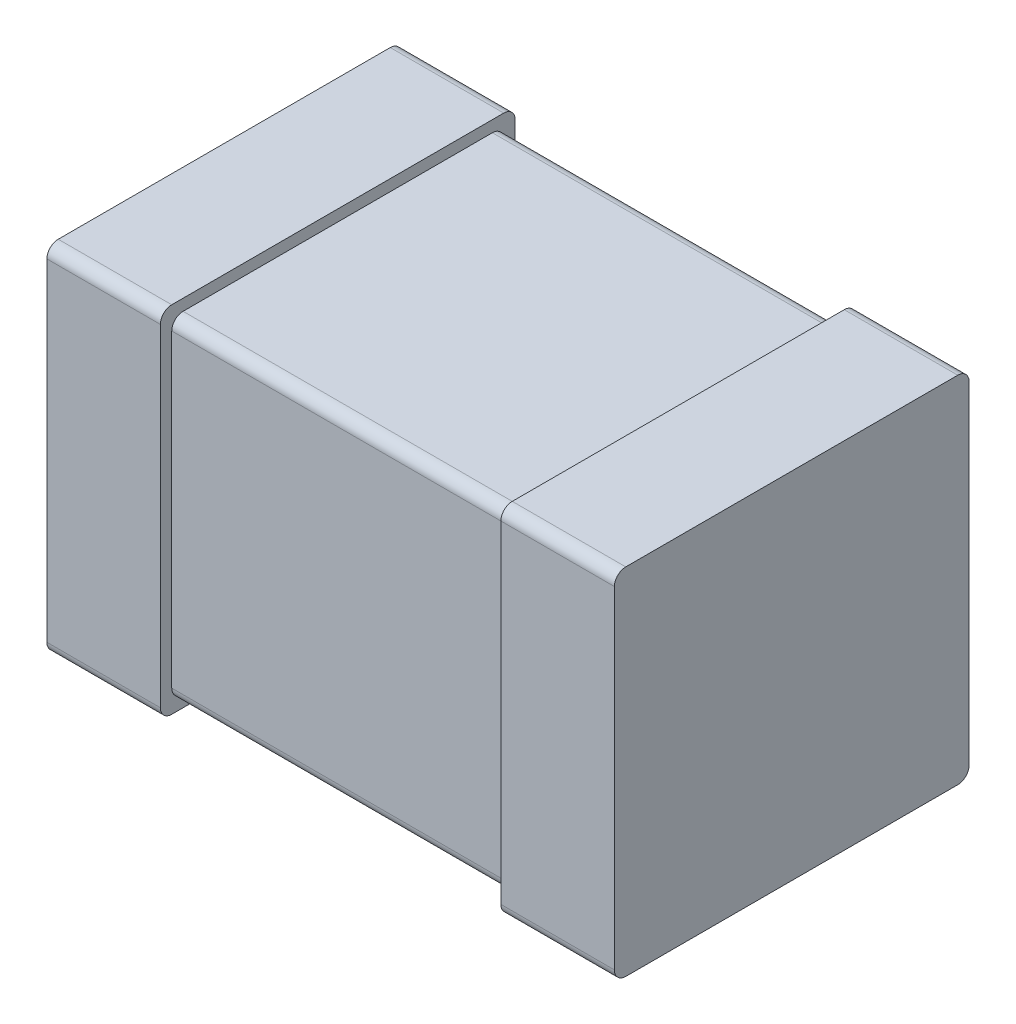
ISO-10303-21;
HEADER;
FILE_DESCRIPTION(('STEP AP214'),'2;1');
FILE_NAME('part.step','',(''),(''),'','','');
FILE_SCHEMA(('AUTOMOTIVE_DESIGN { 1 0 10303 214 1 1 1 1 }'));
ENDSEC;
DATA;
#1=APPLICATION_CONTEXT('core data for automotive mechanical design processes');
#2=APPLICATION_PROTOCOL_DEFINITION('international standard','automotive_design',2000,#1);
#3=PRODUCT_CONTEXT('',#1,'mechanical');
#4=PRODUCT('Part','Part','',(#3));
#5=PRODUCT_RELATED_PRODUCT_CATEGORY('part','',(#4));
#6=PRODUCT_DEFINITION_FORMATION('','',#4);
#7=PRODUCT_DEFINITION_CONTEXT('part definition',#1,'design');
#8=PRODUCT_DEFINITION('design','',#6,#7);
#9=PRODUCT_DEFINITION_SHAPE('','',#8);
#10=(LENGTH_UNIT() NAMED_UNIT(*) SI_UNIT(.MILLI.,.METRE.));
#11=(NAMED_UNIT(*) PLANE_ANGLE_UNIT() SI_UNIT($,.RADIAN.));
#12=(NAMED_UNIT(*) SI_UNIT($,.STERADIAN.) SOLID_ANGLE_UNIT());
#13=UNCERTAINTY_MEASURE_WITH_UNIT(LENGTH_MEASURE(1.E-05),#10,'distance_accuracy_value','');
#14=(GEOMETRIC_REPRESENTATION_CONTEXT(3) GLOBAL_UNCERTAINTY_ASSIGNED_CONTEXT((#13)) GLOBAL_UNIT_ASSIGNED_CONTEXT((#10,
#11,#12)) REPRESENTATION_CONTEXT('',''));
#15=CARTESIAN_POINT('',(0.,0.,0.));
#16=DIRECTION('',(0.,0.,1.));
#17=DIRECTION('',(1.,0.,0.));
#18=AXIS2_PLACEMENT_3D('',#15,#16,#17);
#19=CARTESIAN_POINT('',(1.,-0.625,0.));
#20=DIRECTION('',(1.,0.,0.));
#21=DIRECTION('',(0.,0.,-1.));
#22=AXIS2_PLACEMENT_3D('',#19,#20,#21);
#23=PLANE('',#22);
#24=DIRECTION('',(0.,1.,0.));
#25=VECTOR('',#24,1.);
#26=CARTESIAN_POINT('',(1.,-0.625,1.25));
#27=LINE('',#26,#25);
#28=CARTESIAN_POINT('',(1.,-0.585,1.25));
#29=VERTEX_POINT('',#28);
#30=CARTESIAN_POINT('',(1.,0.585,1.25));
#31=VERTEX_POINT('',#30);
#32=EDGE_CURVE('E199',#29,#31,#27,.T.);
#33=ORIENTED_EDGE('',*,*,#32,.F.);
#34=CARTESIAN_POINT('',(1.,-0.585,1.21));
#35=DIRECTION('',(1.,0.,0.));
#36=DIRECTION('',(0.,0.,-1.));
#37=AXIS2_PLACEMENT_3D('',#34,#35,#36);
#38=CIRCLE('',#37,0.04);
#39=CARTESIAN_POINT('',(1.,-0.625,1.21));
#40=VERTEX_POINT('',#39);
#41=EDGE_CURVE('E186',#40,#29,#38,.F.);
#42=ORIENTED_EDGE('',*,*,#41,.F.);
#43=DIRECTION('',(0.,0.,1.));
#44=VECTOR('',#43,1.);
#45=CARTESIAN_POINT('',(1.,-0.625,0.));
#46=LINE('',#45,#44);
#47=CARTESIAN_POINT('',(1.,-0.625,0.04));
#48=VERTEX_POINT('',#47);
#49=EDGE_CURVE('E183',#40,#48,#46,.F.);
#50=ORIENTED_EDGE('',*,*,#49,.T.);
#51=CARTESIAN_POINT('',(1.,-0.585,0.04));
#52=DIRECTION('',(1.,0.,0.));
#53=DIRECTION('',(0.,0.,-1.));
#54=AXIS2_PLACEMENT_3D('',#51,#52,#53);
#55=CIRCLE('',#54,0.04);
#56=CARTESIAN_POINT('',(1.,-0.585,0.));
#57=VERTEX_POINT('',#56);
#58=EDGE_CURVE('E19',#57,#48,#55,.F.);
#59=ORIENTED_EDGE('',*,*,#58,.F.);
#60=DIRECTION('',(0.,1.,0.));
#61=VECTOR('',#60,1.);
#62=CARTESIAN_POINT('',(1.,-0.625,0.));
#63=LINE('',#62,#61);
#64=CARTESIAN_POINT('',(1.,0.585,0.));
#65=VERTEX_POINT('',#64);
#66=EDGE_CURVE('E195',#57,#65,#63,.T.);
#67=ORIENTED_EDGE('',*,*,#66,.T.);
#68=CARTESIAN_POINT('',(1.,0.585,0.04));
#69=DIRECTION('',(1.,0.,0.));
#70=DIRECTION('',(0.,0.,-1.));
#71=AXIS2_PLACEMENT_3D('',#68,#69,#70);
#72=CIRCLE('',#71,0.04);
#73=CARTESIAN_POINT('',(1.,0.625,0.04));
#74=VERTEX_POINT('',#73);
#75=EDGE_CURVE('E207',#74,#65,#72,.F.);
#76=ORIENTED_EDGE('',*,*,#75,.F.);
#77=DIRECTION('',(0.,0.,1.));
#78=VECTOR('',#77,1.);
#79=CARTESIAN_POINT('',(1.,0.625,0.));
#80=LINE('',#79,#78);
#81=CARTESIAN_POINT('',(1.,0.625,1.21));
#82=VERTEX_POINT('',#81);
#83=EDGE_CURVE('E203',#82,#74,#80,.F.);
#84=ORIENTED_EDGE('',*,*,#83,.F.);
#85=CARTESIAN_POINT('',(1.,0.585,1.21));
#86=DIRECTION('',(1.,0.,0.));
#87=DIRECTION('',(0.,0.,-1.));
#88=AXIS2_PLACEMENT_3D('',#85,#86,#87);
#89=CIRCLE('',#88,0.04);
#90=EDGE_CURVE('E281',#31,#82,#89,.F.);
#91=ORIENTED_EDGE('',*,*,#90,.F.);
#92=EDGE_LOOP('',(#33,#42,#50,#59,#67,#76,#84,#91));
#93=FACE_BOUND('',#92,.T.);
#94=ADVANCED_FACE('F16',(#93),#23,.T.);
#95=CARTESIAN_POINT('',(0.6,-0.625,0.));
#96=DIRECTION('',(0.,1.,0.));
#97=DIRECTION('',(0.,0.,1.));
#98=AXIS2_PLACEMENT_3D('',#95,#96,#97);
#99=PLANE('',#98);
#100=DIRECTION('',(0.,0.,-1.));
#101=VECTOR('',#100,1.);
#102=CARTESIAN_POINT('',(0.6,-0.625,0.));
#103=LINE('',#102,#101);
#104=CARTESIAN_POINT('',(0.6,-0.625,1.21));
#105=VERTEX_POINT('',#104);
#106=CARTESIAN_POINT('',(0.6,-0.625,0.04));
#107=VERTEX_POINT('',#106);
#108=EDGE_CURVE('E193',#105,#107,#103,.T.);
#109=ORIENTED_EDGE('',*,*,#108,.T.);
#110=DIRECTION('',(1.,0.,0.));
#111=VECTOR('',#110,1.);
#112=CARTESIAN_POINT('',(0.6,-0.625,0.04));
#113=LINE('',#112,#111);
#114=EDGE_CURVE('E180',#48,#107,#113,.F.);
#115=ORIENTED_EDGE('',*,*,#114,.F.);
#116=ORIENTED_EDGE('',*,*,#49,.F.);
#117=DIRECTION('',(1.,0.,0.));
#118=VECTOR('',#117,1.);
#119=CARTESIAN_POINT('',(0.6,-0.625,1.21));
#120=LINE('',#119,#118);
#121=EDGE_CURVE('E280',#105,#40,#120,.T.);
#122=ORIENTED_EDGE('',*,*,#121,.F.);
#123=EDGE_LOOP('',(#109,#115,#116,#122));
#124=FACE_BOUND('',#123,.T.);
#125=ADVANCED_FACE('F192',(#124),#99,.F.);
#126=CARTESIAN_POINT('',(0.6,-0.585,0.04));
#127=DIRECTION('',(1.,0.,0.));
#128=DIRECTION('',(0.,0.,-1.));
#129=AXIS2_PLACEMENT_3D('',#126,#127,#128);
#130=CYLINDRICAL_SURFACE('',#129,0.04);
#131=ORIENTED_EDGE('',*,*,#58,.T.);
#132=ORIENTED_EDGE('',*,*,#114,.T.);
#133=CARTESIAN_POINT('',(0.6,-0.585,0.04));
#134=DIRECTION('',(1.,0.,0.));
#135=DIRECTION('',(0.,0.,-1.));
#136=AXIS2_PLACEMENT_3D('',#133,#134,#135);
#137=CIRCLE('',#136,0.04);
#138=CARTESIAN_POINT('',(0.6,-0.585,0.));
#139=VERTEX_POINT('',#138);
#140=EDGE_CURVE('E276',#107,#139,#137,.T.);
#141=ORIENTED_EDGE('',*,*,#140,.T.);
#142=DIRECTION('',(1.,0.,0.));
#143=VECTOR('',#142,1.);
#144=CARTESIAN_POINT('',(0.6,-0.585,0.));
#145=LINE('',#144,#143);
#146=EDGE_CURVE('E182',#139,#57,#145,.T.);
#147=ORIENTED_EDGE('',*,*,#146,.T.);
#148=EDGE_LOOP('',(#131,#132,#141,#147));
#149=FACE_BOUND('',#148,.T.);
#150=ADVANCED_FACE('F177',(#149),#130,.T.);
#151=CARTESIAN_POINT('',(0.6,-0.625,0.));
#152=DIRECTION('',(0.,0.,1.));
#153=DIRECTION('',(1.,0.,0.));
#154=AXIS2_PLACEMENT_3D('',#151,#152,#153);
#155=PLANE('',#154);
#156=ORIENTED_EDGE('',*,*,#66,.F.);
#157=ORIENTED_EDGE('',*,*,#146,.F.);
#158=DIRECTION('',(0.,1.,0.));
#159=VECTOR('',#158,1.);
#160=CARTESIAN_POINT('',(0.6,-0.625,0.));
#161=LINE('',#160,#159);
#162=CARTESIAN_POINT('',(0.6,0.585,0.));
#163=VERTEX_POINT('',#162);
#164=EDGE_CURVE('E275',#139,#163,#161,.T.);
#165=ORIENTED_EDGE('',*,*,#164,.T.);
#166=DIRECTION('',(1.,0.,0.));
#167=VECTOR('',#166,1.);
#168=CARTESIAN_POINT('',(0.6,0.585,0.));
#169=LINE('',#168,#167);
#170=EDGE_CURVE('E206',#65,#163,#169,.F.);
#171=ORIENTED_EDGE('',*,*,#170,.F.);
#172=EDGE_LOOP('',(#156,#157,#165,#171));
#173=FACE_BOUND('',#172,.T.);
#174=ADVANCED_FACE('F473',(#173),#155,.F.);
#175=CARTESIAN_POINT('',(0.6,0.585,0.04));
#176=DIRECTION('',(1.,0.,0.));
#177=DIRECTION('',(0.,0.,-1.));
#178=AXIS2_PLACEMENT_3D('',#175,#176,#177);
#179=CYLINDRICAL_SURFACE('',#178,0.04);
#180=ORIENTED_EDGE('',*,*,#170,.T.);
#181=CARTESIAN_POINT('',(0.6,0.585,0.04));
#182=DIRECTION('',(1.,0.,0.));
#183=DIRECTION('',(0.,0.,-1.));
#184=AXIS2_PLACEMENT_3D('',#181,#182,#183);
#185=CIRCLE('',#184,0.04);
#186=CARTESIAN_POINT('',(0.6,0.625,0.04));
#187=VERTEX_POINT('',#186);
#188=EDGE_CURVE('E272',#163,#187,#185,.T.);
#189=ORIENTED_EDGE('',*,*,#188,.T.);
#190=DIRECTION('',(1.,0.,0.));
#191=VECTOR('',#190,1.);
#192=CARTESIAN_POINT('',(0.6,0.625,0.04));
#193=LINE('',#192,#191);
#194=EDGE_CURVE('E205',#74,#187,#193,.F.);
#195=ORIENTED_EDGE('',*,*,#194,.F.);
#196=ORIENTED_EDGE('',*,*,#75,.T.);
#197=EDGE_LOOP('',(#180,#189,#195,#196));
#198=FACE_BOUND('',#197,.T.);
#199=ADVANCED_FACE('F469',(#198),#179,.T.);
#200=CARTESIAN_POINT('',(0.6,0.625,0.));
#201=DIRECTION('',(0.,1.,0.));
#202=DIRECTION('',(0.,0.,1.));
#203=AXIS2_PLACEMENT_3D('',#200,#201,#202);
#204=PLANE('',#203);
#205=DIRECTION('',(0.,0.,-1.));
#206=VECTOR('',#205,1.);
#207=CARTESIAN_POINT('',(0.6,0.625,0.));
#208=LINE('',#207,#206);
#209=CARTESIAN_POINT('',(0.6,0.625,1.21));
#210=VERTEX_POINT('',#209);
#211=EDGE_CURVE('E271',#187,#210,#208,.F.);
#212=ORIENTED_EDGE('',*,*,#211,.T.);
#213=DIRECTION('',(1.,0.,0.));
#214=VECTOR('',#213,1.);
#215=CARTESIAN_POINT('',(0.6,0.625,1.21));
#216=LINE('',#215,#214);
#217=EDGE_CURVE('E201',#82,#210,#216,.F.);
#218=ORIENTED_EDGE('',*,*,#217,.F.);
#219=ORIENTED_EDGE('',*,*,#83,.T.);
#220=ORIENTED_EDGE('',*,*,#194,.T.);
#221=EDGE_LOOP('',(#212,#218,#219,#220));
#222=FACE_BOUND('',#221,.T.);
#223=ADVANCED_FACE('F465',(#222),#204,.T.);
#224=CARTESIAN_POINT('',(0.6,0.585,1.21));
#225=DIRECTION('',(1.,0.,0.));
#226=DIRECTION('',(0.,0.,-1.));
#227=AXIS2_PLACEMENT_3D('',#224,#225,#226);
#228=CYLINDRICAL_SURFACE('',#227,0.04);
#229=ORIENTED_EDGE('',*,*,#90,.T.);
#230=ORIENTED_EDGE('',*,*,#217,.T.);
#231=CARTESIAN_POINT('',(0.6,0.585,1.21));
#232=DIRECTION('',(1.,0.,0.));
#233=DIRECTION('',(0.,0.,-1.));
#234=AXIS2_PLACEMENT_3D('',#231,#232,#233);
#235=CIRCLE('',#234,0.04);
#236=CARTESIAN_POINT('',(0.6,0.585,1.25));
#237=VERTEX_POINT('',#236);
#238=EDGE_CURVE('E268',#210,#237,#235,.T.);
#239=ORIENTED_EDGE('',*,*,#238,.T.);
#240=DIRECTION('',(1.,0.,0.));
#241=VECTOR('',#240,1.);
#242=CARTESIAN_POINT('',(0.6,0.585,1.25));
#243=LINE('',#242,#241);
#244=EDGE_CURVE('E200',#31,#237,#243,.F.);
#245=ORIENTED_EDGE('',*,*,#244,.F.);
#246=EDGE_LOOP('',(#229,#230,#239,#245));
#247=FACE_BOUND('',#246,.T.);
#248=ADVANCED_FACE('F461',(#247),#228,.T.);
#249=CARTESIAN_POINT('',(0.6,-0.625,1.25));
#250=DIRECTION('',(0.,0.,1.));
#251=DIRECTION('',(1.,0.,0.));
#252=AXIS2_PLACEMENT_3D('',#249,#250,#251);
#253=PLANE('',#252);
#254=ORIENTED_EDGE('',*,*,#32,.T.);
#255=ORIENTED_EDGE('',*,*,#244,.T.);
#256=DIRECTION('',(0.,1.,0.));
#257=VECTOR('',#256,1.);
#258=CARTESIAN_POINT('',(0.6,-0.625,1.25));
#259=LINE('',#258,#257);
#260=CARTESIAN_POINT('',(0.6,-0.585,1.25));
#261=VERTEX_POINT('',#260);
#262=EDGE_CURVE('E267',#237,#261,#259,.F.);
#263=ORIENTED_EDGE('',*,*,#262,.T.);
#264=DIRECTION('',(1.,0.,0.));
#265=VECTOR('',#264,1.);
#266=CARTESIAN_POINT('',(0.6,-0.585,1.25));
#267=LINE('',#266,#265);
#268=EDGE_CURVE('E279',#29,#261,#267,.F.);
#269=ORIENTED_EDGE('',*,*,#268,.F.);
#270=EDGE_LOOP('',(#254,#255,#263,#269));
#271=FACE_BOUND('',#270,.T.);
#272=ADVANCED_FACE('F457',(#271),#253,.T.);
#273=CARTESIAN_POINT('',(0.6,-0.585,1.21));
#274=DIRECTION('',(1.,0.,0.));
#275=DIRECTION('',(0.,0.,-1.));
#276=AXIS2_PLACEMENT_3D('',#273,#274,#275);
#277=CYLINDRICAL_SURFACE('',#276,0.04);
#278=ORIENTED_EDGE('',*,*,#268,.T.);
#279=CARTESIAN_POINT('',(0.6,-0.585,1.21));
#280=DIRECTION('',(1.,0.,0.));
#281=DIRECTION('',(0.,0.,-1.));
#282=AXIS2_PLACEMENT_3D('',#279,#280,#281);
#283=CIRCLE('',#282,0.04);
#284=EDGE_CURVE('E264',#261,#105,#283,.T.);
#285=ORIENTED_EDGE('',*,*,#284,.T.);
#286=ORIENTED_EDGE('',*,*,#121,.T.);
#287=ORIENTED_EDGE('',*,*,#41,.T.);
#288=EDGE_LOOP('',(#278,#285,#286,#287));
#289=FACE_BOUND('',#288,.T.);
#290=ADVANCED_FACE('F453',(#289),#277,.T.);
#291=CARTESIAN_POINT('',(0.6,-0.625,0.));
#292=DIRECTION('',(1.,0.,0.));
#293=DIRECTION('',(0.,0.,-1.));
#294=AXIS2_PLACEMENT_3D('',#291,#292,#293);
#295=PLANE('',#294);
#296=CARTESIAN_POINT('',(0.6,0.545,0.08));
#297=DIRECTION('',(1.,0.,0.));
#298=DIRECTION('',(0.,0.,-1.));
#299=AXIS2_PLACEMENT_3D('',#296,#297,#298);
#300=CIRCLE('',#299,0.04);
#301=CARTESIAN_POINT('',(0.6,0.585,0.08));
#302=VERTEX_POINT('',#301);
#303=CARTESIAN_POINT('',(0.6,0.545,0.04));
#304=VERTEX_POINT('',#303);
#305=EDGE_CURVE('E249',#302,#304,#300,.F.);
#306=ORIENTED_EDGE('',*,*,#305,.F.);
#307=DIRECTION('',(0.,0.,1.));
#308=VECTOR('',#307,1.);
#309=CARTESIAN_POINT('',(0.6,0.585,0.04));
#310=LINE('',#309,#308);
#311=CARTESIAN_POINT('',(0.6,0.585,1.17));
#312=VERTEX_POINT('',#311);
#313=EDGE_CURVE('E255',#312,#302,#310,.F.);
#314=ORIENTED_EDGE('',*,*,#313,.F.);
#315=CARTESIAN_POINT('',(0.6,0.545,1.17));
#316=DIRECTION('',(1.,0.,0.));
#317=DIRECTION('',(0.,0.,-1.));
#318=AXIS2_PLACEMENT_3D('',#315,#316,#317);
#319=CIRCLE('',#318,0.04);
#320=CARTESIAN_POINT('',(0.6,0.545,1.21));
#321=VERTEX_POINT('',#320);
#322=EDGE_CURVE('E253',#321,#312,#319,.F.);
#323=ORIENTED_EDGE('',*,*,#322,.F.);
#324=DIRECTION('',(0.,1.,0.));
#325=VECTOR('',#324,1.);
#326=CARTESIAN_POINT('',(0.6,-0.585,1.21));
#327=LINE('',#326,#325);
#328=CARTESIAN_POINT('',(0.6,-0.545,1.21));
#329=VERTEX_POINT('',#328);
#330=EDGE_CURVE('E296',#329,#321,#327,.T.);
#331=ORIENTED_EDGE('',*,*,#330,.F.);
#332=CARTESIAN_POINT('',(0.6,-0.545,1.17));
#333=DIRECTION('',(1.,0.,0.));
#334=DIRECTION('',(0.,0.,-1.));
#335=AXIS2_PLACEMENT_3D('',#332,#333,#334);
#336=CIRCLE('',#335,0.04);
#337=CARTESIAN_POINT('',(0.6,-0.585,1.17));
#338=VERTEX_POINT('',#337);
#339=EDGE_CURVE('E257',#338,#329,#336,.F.);
#340=ORIENTED_EDGE('',*,*,#339,.F.);
#341=DIRECTION('',(0.,0.,1.));
#342=VECTOR('',#341,1.);
#343=CARTESIAN_POINT('',(0.6,-0.585,0.04));
#344=LINE('',#343,#342);
#345=CARTESIAN_POINT('',(0.6,-0.585,0.08));
#346=VERTEX_POINT('',#345);
#347=EDGE_CURVE('E263',#338,#346,#344,.F.);
#348=ORIENTED_EDGE('',*,*,#347,.T.);
#349=CARTESIAN_POINT('',(0.6,-0.545,0.08));
#350=DIRECTION('',(1.,0.,0.));
#351=DIRECTION('',(0.,0.,-1.));
#352=AXIS2_PLACEMENT_3D('',#349,#350,#351);
#353=CIRCLE('',#352,0.04);
#354=CARTESIAN_POINT('',(0.6,-0.545,0.04));
#355=VERTEX_POINT('',#354);
#356=EDGE_CURVE('E261',#355,#346,#353,.F.);
#357=ORIENTED_EDGE('',*,*,#356,.F.);
#358=DIRECTION('',(0.,1.,0.));
#359=VECTOR('',#358,1.);
#360=CARTESIAN_POINT('',(0.6,-0.585,0.04));
#361=LINE('',#360,#359);
#362=EDGE_CURVE('E307',#355,#304,#361,.T.);
#363=ORIENTED_EDGE('',*,*,#362,.T.);
#364=EDGE_LOOP('',(#306,#314,#323,#331,#340,#348,#357,#363));
#365=FACE_BOUND('',#364,.T.);
#366=ORIENTED_EDGE('',*,*,#262,.F.);
#367=ORIENTED_EDGE('',*,*,#238,.F.);
#368=ORIENTED_EDGE('',*,*,#211,.F.);
#369=ORIENTED_EDGE('',*,*,#188,.F.);
#370=ORIENTED_EDGE('',*,*,#164,.F.);
#371=ORIENTED_EDGE('',*,*,#140,.F.);
#372=ORIENTED_EDGE('',*,*,#108,.F.);
#373=ORIENTED_EDGE('',*,*,#284,.F.);
#374=EDGE_LOOP('',(#366,#367,#368,#369,#370,#371,#372,#373));
#375=FACE_BOUND('',#374,.T.);
#376=ADVANCED_FACE('F449',(#365,#375),#295,.F.);
#377=CARTESIAN_POINT('',(-0.6,-0.545,0.08));
#378=DIRECTION('',(1.,0.,0.));
#379=DIRECTION('',(0.,0.,-1.));
#380=AXIS2_PLACEMENT_3D('',#377,#378,#379);
#381=CYLINDRICAL_SURFACE('',#380,0.04);
#382=ORIENTED_EDGE('',*,*,#356,.T.);
#383=DIRECTION('',(1.,0.,0.));
#384=VECTOR('',#383,1.);
#385=CARTESIAN_POINT('',(-0.6,-0.585,0.08));
#386=LINE('',#385,#384);
#387=CARTESIAN_POINT('',(-0.6,-0.585,0.08));
#388=VERTEX_POINT('',#387);
#389=EDGE_CURVE('E295',#346,#388,#386,.F.);
#390=ORIENTED_EDGE('',*,*,#389,.T.);
#391=CARTESIAN_POINT('',(-0.6,-0.545,0.08));
#392=DIRECTION('',(1.,0.,0.));
#393=DIRECTION('',(0.,0.,-1.));
#394=AXIS2_PLACEMENT_3D('',#391,#392,#393);
#395=CIRCLE('',#394,0.04);
#396=CARTESIAN_POINT('',(-0.6,-0.545,0.04));
#397=VERTEX_POINT('',#396);
#398=EDGE_CURVE('E246',#397,#388,#395,.F.);
#399=ORIENTED_EDGE('',*,*,#398,.F.);
#400=DIRECTION('',(1.,0.,0.));
#401=VECTOR('',#400,1.);
#402=CARTESIAN_POINT('',(-0.6,-0.545,0.04));
#403=LINE('',#402,#401);
#404=EDGE_CURVE('E251',#397,#355,#403,.T.);
#405=ORIENTED_EDGE('',*,*,#404,.T.);
#406=EDGE_LOOP('',(#382,#390,#399,#405));
#407=FACE_BOUND('',#406,.T.);
#408=ADVANCED_FACE('F445',(#407),#381,.T.);
#409=CARTESIAN_POINT('',(-0.6,-0.585,0.04));
#410=DIRECTION('',(0.,1.,0.));
#411=DIRECTION('',(0.,0.,1.));
#412=AXIS2_PLACEMENT_3D('',#409,#410,#411);
#413=PLANE('',#412);
#414=DIRECTION('',(0.,0.,-1.));
#415=VECTOR('',#414,1.);
#416=CARTESIAN_POINT('',(-0.6,-0.585,0.));
#417=LINE('',#416,#415);
#418=CARTESIAN_POINT('',(-0.6,-0.585,1.17));
#419=VERTEX_POINT('',#418);
#420=EDGE_CURVE('E245',#388,#419,#417,.F.);
#421=ORIENTED_EDGE('',*,*,#420,.F.);
#422=ORIENTED_EDGE('',*,*,#389,.F.);
#423=ORIENTED_EDGE('',*,*,#347,.F.);
#424=DIRECTION('',(1.,0.,0.));
#425=VECTOR('',#424,1.);
#426=CARTESIAN_POINT('',(-0.6,-0.585,1.17));
#427=LINE('',#426,#425);
#428=EDGE_CURVE('E260',#419,#338,#427,.T.);
#429=ORIENTED_EDGE('',*,*,#428,.F.);
#430=EDGE_LOOP('',(#421,#422,#423,#429));
#431=FACE_BOUND('',#430,.T.);
#432=ADVANCED_FACE('F441',(#431),#413,.F.);
#433=CARTESIAN_POINT('',(-0.6,-0.545,1.17));
#434=DIRECTION('',(1.,0.,0.));
#435=DIRECTION('',(0.,0.,-1.));
#436=AXIS2_PLACEMENT_3D('',#433,#434,#435);
#437=CYLINDRICAL_SURFACE('',#436,0.04);
#438=DIRECTION('',(1.,0.,0.));
#439=VECTOR('',#438,1.);
#440=CARTESIAN_POINT('',(-0.6,-0.545,1.21));
#441=LINE('',#440,#439);
#442=CARTESIAN_POINT('',(-0.6,-0.545,1.21));
#443=VERTEX_POINT('',#442);
#444=EDGE_CURVE('E259',#443,#329,#441,.T.);
#445=ORIENTED_EDGE('',*,*,#444,.F.);
#446=CARTESIAN_POINT('',(-0.6,-0.545,1.17));
#447=DIRECTION('',(1.,0.,0.));
#448=DIRECTION('',(0.,0.,-1.));
#449=AXIS2_PLACEMENT_3D('',#446,#447,#448);
#450=CIRCLE('',#449,0.04);
#451=EDGE_CURVE('E243',#419,#443,#450,.F.);
#452=ORIENTED_EDGE('',*,*,#451,.F.);
#453=ORIENTED_EDGE('',*,*,#428,.T.);
#454=ORIENTED_EDGE('',*,*,#339,.T.);
#455=EDGE_LOOP('',(#445,#452,#453,#454));
#456=FACE_BOUND('',#455,.T.);
#457=ADVANCED_FACE('F437',(#456),#437,.T.);
#458=CARTESIAN_POINT('',(-0.6,-0.585,1.21));
#459=DIRECTION('',(0.,0.,1.));
#460=DIRECTION('',(1.,0.,0.));
#461=AXIS2_PLACEMENT_3D('',#458,#459,#460);
#462=PLANE('',#461);
#463=ORIENTED_EDGE('',*,*,#330,.T.);
#464=DIRECTION('',(1.,0.,0.));
#465=VECTOR('',#464,1.);
#466=CARTESIAN_POINT('',(-0.6,0.545,1.21));
#467=LINE('',#466,#465);
#468=CARTESIAN_POINT('',(-0.6,0.545,1.21));
#469=VERTEX_POINT('',#468);
#470=EDGE_CURVE('E256',#469,#321,#467,.T.);
#471=ORIENTED_EDGE('',*,*,#470,.F.);
#472=DIRECTION('',(0.,1.,0.));
#473=VECTOR('',#472,1.);
#474=CARTESIAN_POINT('',(-0.6,-0.625,1.21));
#475=LINE('',#474,#473);
#476=EDGE_CURVE('E242',#443,#469,#475,.T.);
#477=ORIENTED_EDGE('',*,*,#476,.F.);
#478=ORIENTED_EDGE('',*,*,#444,.T.);
#479=EDGE_LOOP('',(#463,#471,#477,#478));
#480=FACE_BOUND('',#479,.T.);
#481=ADVANCED_FACE('F433',(#480),#462,.T.);
#482=CARTESIAN_POINT('',(-0.6,0.545,1.17));
#483=DIRECTION('',(1.,0.,0.));
#484=DIRECTION('',(0.,0.,-1.));
#485=AXIS2_PLACEMENT_3D('',#482,#483,#484);
#486=CYLINDRICAL_SURFACE('',#485,0.04);
#487=ORIENTED_EDGE('',*,*,#322,.T.);
#488=DIRECTION('',(1.,0.,0.));
#489=VECTOR('',#488,1.);
#490=CARTESIAN_POINT('',(-0.6,0.585,1.17));
#491=LINE('',#490,#489);
#492=CARTESIAN_POINT('',(-0.6,0.585,1.17));
#493=VERTEX_POINT('',#492);
#494=EDGE_CURVE('E299',#493,#312,#491,.T.);
#495=ORIENTED_EDGE('',*,*,#494,.F.);
#496=CARTESIAN_POINT('',(-0.6,0.545,1.17));
#497=DIRECTION('',(1.,0.,0.));
#498=DIRECTION('',(0.,0.,-1.));
#499=AXIS2_PLACEMENT_3D('',#496,#497,#498);
#500=CIRCLE('',#499,0.04);
#501=EDGE_CURVE('E240',#469,#493,#500,.F.);
#502=ORIENTED_EDGE('',*,*,#501,.F.);
#503=ORIENTED_EDGE('',*,*,#470,.T.);
#504=EDGE_LOOP('',(#487,#495,#502,#503));
#505=FACE_BOUND('',#504,.T.);
#506=ADVANCED_FACE('F429',(#505),#486,.T.);
#507=CARTESIAN_POINT('',(-0.6,0.585,0.04));
#508=DIRECTION('',(0.,1.,0.));
#509=DIRECTION('',(0.,0.,1.));
#510=AXIS2_PLACEMENT_3D('',#507,#508,#509);
#511=PLANE('',#510);
#512=DIRECTION('',(0.,0.,-1.));
#513=VECTOR('',#512,1.);
#514=CARTESIAN_POINT('',(-0.6,0.585,0.));
#515=LINE('',#514,#513);
#516=CARTESIAN_POINT('',(-0.6,0.585,0.08));
#517=VERTEX_POINT('',#516);
#518=EDGE_CURVE('E239',#493,#517,#515,.T.);
#519=ORIENTED_EDGE('',*,*,#518,.F.);
#520=ORIENTED_EDGE('',*,*,#494,.T.);
#521=ORIENTED_EDGE('',*,*,#313,.T.);
#522=DIRECTION('',(1.,0.,0.));
#523=VECTOR('',#522,1.);
#524=CARTESIAN_POINT('',(-0.6,0.585,0.08));
#525=LINE('',#524,#523);
#526=EDGE_CURVE('E252',#517,#302,#525,.T.);
#527=ORIENTED_EDGE('',*,*,#526,.F.);
#528=EDGE_LOOP('',(#519,#520,#521,#527));
#529=FACE_BOUND('',#528,.T.);
#530=ADVANCED_FACE('F425',(#529),#511,.T.);
#531=CARTESIAN_POINT('',(-0.6,0.545,0.08));
#532=DIRECTION('',(1.,0.,0.));
#533=DIRECTION('',(0.,0.,-1.));
#534=AXIS2_PLACEMENT_3D('',#531,#532,#533);
#535=CYLINDRICAL_SURFACE('',#534,0.04);
#536=DIRECTION('',(1.,0.,0.));
#537=VECTOR('',#536,1.);
#538=CARTESIAN_POINT('',(-0.6,0.545,0.04));
#539=LINE('',#538,#537);
#540=CARTESIAN_POINT('',(-0.6,0.545,0.04));
#541=VERTEX_POINT('',#540);
#542=EDGE_CURVE('E248',#304,#541,#539,.F.);
#543=ORIENTED_EDGE('',*,*,#542,.T.);
#544=CARTESIAN_POINT('',(-0.6,0.545,0.08));
#545=DIRECTION('',(1.,0.,0.));
#546=DIRECTION('',(0.,0.,-1.));
#547=AXIS2_PLACEMENT_3D('',#544,#545,#546);
#548=CIRCLE('',#547,0.04);
#549=EDGE_CURVE('E236',#517,#541,#548,.F.);
#550=ORIENTED_EDGE('',*,*,#549,.F.);
#551=ORIENTED_EDGE('',*,*,#526,.T.);
#552=ORIENTED_EDGE('',*,*,#305,.T.);
#553=EDGE_LOOP('',(#543,#550,#551,#552));
#554=FACE_BOUND('',#553,.T.);
#555=ADVANCED_FACE('F421',(#554),#535,.T.);
#556=CARTESIAN_POINT('',(-0.6,-0.585,0.04));
#557=DIRECTION('',(0.,0.,1.));
#558=DIRECTION('',(1.,0.,0.));
#559=AXIS2_PLACEMENT_3D('',#556,#557,#558);
#560=PLANE('',#559);
#561=ORIENTED_EDGE('',*,*,#362,.F.);
#562=ORIENTED_EDGE('',*,*,#404,.F.);
#563=DIRECTION('',(0.,1.,0.));
#564=VECTOR('',#563,1.);
#565=CARTESIAN_POINT('',(-0.6,-0.625,0.04));
#566=LINE('',#565,#564);
#567=EDGE_CURVE('E238',#541,#397,#566,.F.);
#568=ORIENTED_EDGE('',*,*,#567,.F.);
#569=ORIENTED_EDGE('',*,*,#542,.F.);
#570=EDGE_LOOP('',(#561,#562,#568,#569));
#571=FACE_BOUND('',#570,.T.);
#572=ADVANCED_FACE('F417',(#571),#560,.F.);
#573=CARTESIAN_POINT('',(-0.6,-0.625,0.));
#574=DIRECTION('',(1.,0.,0.));
#575=DIRECTION('',(0.,0.,-1.));
#576=AXIS2_PLACEMENT_3D('',#573,#574,#575);
#577=PLANE('',#576);
#578=ORIENTED_EDGE('',*,*,#549,.T.);
#579=ORIENTED_EDGE('',*,*,#567,.T.);
#580=ORIENTED_EDGE('',*,*,#398,.T.);
#581=ORIENTED_EDGE('',*,*,#420,.T.);
#582=ORIENTED_EDGE('',*,*,#451,.T.);
#583=ORIENTED_EDGE('',*,*,#476,.T.);
#584=ORIENTED_EDGE('',*,*,#501,.T.);
#585=ORIENTED_EDGE('',*,*,#518,.T.);
#586=EDGE_LOOP('',(#578,#579,#580,#581,#582,#583,#584,#585));
#587=FACE_BOUND('',#586,.T.);
#588=DIRECTION('',(0.,1.,0.));
#589=VECTOR('',#588,1.);
#590=CARTESIAN_POINT('',(-0.6,-0.625,1.25));
#591=LINE('',#590,#589);
#592=CARTESIAN_POINT('',(-0.6,-0.585,1.25));
#593=VERTEX_POINT('',#592);
#594=CARTESIAN_POINT('',(-0.6,0.585,1.25));
#595=VERTEX_POINT('',#594);
#596=EDGE_CURVE('E338',#593,#595,#591,.T.);
#597=ORIENTED_EDGE('',*,*,#596,.F.);
#598=CARTESIAN_POINT('',(-0.6,-0.585,1.21));
#599=DIRECTION('',(1.,0.,0.));
#600=DIRECTION('',(0.,0.,-1.));
#601=AXIS2_PLACEMENT_3D('',#598,#599,#600);
#602=CIRCLE('',#601,0.04);
#603=CARTESIAN_POINT('',(-0.6,-0.625,1.21));
#604=VERTEX_POINT('',#603);
#605=EDGE_CURVE('E221',#604,#593,#602,.F.);
#606=ORIENTED_EDGE('',*,*,#605,.F.);
#607=DIRECTION('',(0.,0.,1.));
#608=VECTOR('',#607,1.);
#609=CARTESIAN_POINT('',(-0.6,-0.625,0.));
#610=LINE('',#609,#608);
#611=CARTESIAN_POINT('',(-0.6,-0.625,0.04));
#612=VERTEX_POINT('',#611);
#613=EDGE_CURVE('E235',#604,#612,#610,.F.);
#614=ORIENTED_EDGE('',*,*,#613,.T.);
#615=CARTESIAN_POINT('',(-0.6,-0.585,0.04));
#616=DIRECTION('',(1.,0.,0.));
#617=DIRECTION('',(0.,0.,-1.));
#618=AXIS2_PLACEMENT_3D('',#615,#616,#617);
#619=CIRCLE('',#618,0.04);
#620=CARTESIAN_POINT('',(-0.6,-0.585,0.));
#621=VERTEX_POINT('',#620);
#622=EDGE_CURVE('E232',#621,#612,#619,.F.);
#623=ORIENTED_EDGE('',*,*,#622,.F.);
#624=DIRECTION('',(0.,1.,0.));
#625=VECTOR('',#624,1.);
#626=CARTESIAN_POINT('',(-0.6,-0.625,0.));
#627=LINE('',#626,#625);
#628=CARTESIAN_POINT('',(-0.6,0.585,0.));
#629=VERTEX_POINT('',#628);
#630=EDGE_CURVE('E231',#621,#629,#627,.T.);
#631=ORIENTED_EDGE('',*,*,#630,.T.);
#632=CARTESIAN_POINT('',(-0.6,0.585,0.04));
#633=DIRECTION('',(1.,0.,0.));
#634=DIRECTION('',(0.,0.,-1.));
#635=AXIS2_PLACEMENT_3D('',#632,#633,#634);
#636=CIRCLE('',#635,0.04);
#637=CARTESIAN_POINT('',(-0.6,0.625,0.04));
#638=VERTEX_POINT('',#637);
#639=EDGE_CURVE('E228',#638,#629,#636,.F.);
#640=ORIENTED_EDGE('',*,*,#639,.F.);
#641=DIRECTION('',(0.,0.,1.));
#642=VECTOR('',#641,1.);
#643=CARTESIAN_POINT('',(-0.6,0.625,0.));
#644=LINE('',#643,#642);
#645=CARTESIAN_POINT('',(-0.6,0.625,1.21));
#646=VERTEX_POINT('',#645);
#647=EDGE_CURVE('E329',#646,#638,#644,.F.);
#648=ORIENTED_EDGE('',*,*,#647,.F.);
#649=CARTESIAN_POINT('',(-0.6,0.585,1.21));
#650=DIRECTION('',(1.,0.,0.));
#651=DIRECTION('',(0.,0.,-1.));
#652=AXIS2_PLACEMENT_3D('',#649,#650,#651);
#653=CIRCLE('',#652,0.04);
#654=EDGE_CURVE('E224',#595,#646,#653,.F.);
#655=ORIENTED_EDGE('',*,*,#654,.F.);
#656=EDGE_LOOP('',(#597,#606,#614,#623,#631,#640,#648,#655));
#657=FACE_BOUND('',#656,.T.);
#658=ADVANCED_FACE('F414',(#587,#657),#577,.T.);
#659=CARTESIAN_POINT('',(-1.,-0.625,0.));
#660=DIRECTION('',(0.,1.,0.));
#661=DIRECTION('',(0.,0.,1.));
#662=AXIS2_PLACEMENT_3D('',#659,#660,#661);
#663=PLANE('',#662);
#664=DIRECTION('',(0.,0.,-1.));
#665=VECTOR('',#664,1.);
#666=CARTESIAN_POINT('',(-1.,-0.625,0.));
#667=LINE('',#666,#665);
#668=CARTESIAN_POINT('',(-1.,-0.625,1.21));
#669=VERTEX_POINT('',#668);
#670=CARTESIAN_POINT('',(-1.,-0.625,0.04));
#671=VERTEX_POINT('',#670);
#672=EDGE_CURVE('E220',#669,#671,#667,.T.);
#673=ORIENTED_EDGE('',*,*,#672,.T.);
#674=DIRECTION('',(1.,0.,0.));
#675=VECTOR('',#674,1.);
#676=CARTESIAN_POINT('',(-1.,-0.625,0.04));
#677=LINE('',#676,#675);
#678=EDGE_CURVE('E234',#612,#671,#677,.F.);
#679=ORIENTED_EDGE('',*,*,#678,.F.);
#680=ORIENTED_EDGE('',*,*,#613,.F.);
#681=DIRECTION('',(1.,0.,0.));
#682=VECTOR('',#681,1.);
#683=CARTESIAN_POINT('',(-1.,-0.625,1.21));
#684=LINE('',#683,#682);
#685=EDGE_CURVE('E223',#669,#604,#684,.T.);
#686=ORIENTED_EDGE('',*,*,#685,.F.);
#687=EDGE_LOOP('',(#673,#679,#680,#686));
#688=FACE_BOUND('',#687,.T.);
#689=ADVANCED_FACE('F388',(#688),#663,.F.);
#690=CARTESIAN_POINT('',(-1.,-0.585,0.04));
#691=DIRECTION('',(1.,0.,0.));
#692=DIRECTION('',(0.,0.,-1.));
#693=AXIS2_PLACEMENT_3D('',#690,#691,#692);
#694=CYLINDRICAL_SURFACE('',#693,0.04);
#695=ORIENTED_EDGE('',*,*,#622,.T.);
#696=ORIENTED_EDGE('',*,*,#678,.T.);
#697=CARTESIAN_POINT('',(-1.,-0.585,0.04));
#698=DIRECTION('',(1.,0.,0.));
#699=DIRECTION('',(0.,0.,-1.));
#700=AXIS2_PLACEMENT_3D('',#697,#698,#699);
#701=CIRCLE('',#700,0.04);
#702=CARTESIAN_POINT('',(-1.,-0.585,0.));
#703=VERTEX_POINT('',#702);
#704=EDGE_CURVE('E217',#671,#703,#701,.T.);
#705=ORIENTED_EDGE('',*,*,#704,.T.);
#706=DIRECTION('',(1.,0.,0.));
#707=VECTOR('',#706,1.);
#708=CARTESIAN_POINT('',(-1.,-0.585,0.));
#709=LINE('',#708,#707);
#710=EDGE_CURVE('E328',#703,#621,#709,.T.);
#711=ORIENTED_EDGE('',*,*,#710,.T.);
#712=EDGE_LOOP('',(#695,#696,#705,#711));
#713=FACE_BOUND('',#712,.T.);
#714=ADVANCED_FACE('F385',(#713),#694,.T.);
#715=CARTESIAN_POINT('',(-1.,-0.625,0.));
#716=DIRECTION('',(0.,0.,1.));
#717=DIRECTION('',(1.,0.,0.));
#718=AXIS2_PLACEMENT_3D('',#715,#716,#717);
#719=PLANE('',#718);
#720=ORIENTED_EDGE('',*,*,#630,.F.);
#721=ORIENTED_EDGE('',*,*,#710,.F.);
#722=DIRECTION('',(0.,1.,0.));
#723=VECTOR('',#722,1.);
#724=CARTESIAN_POINT('',(-1.,-0.625,0.));
#725=LINE('',#724,#723);
#726=CARTESIAN_POINT('',(-1.,0.585,0.));
#727=VERTEX_POINT('',#726);
#728=EDGE_CURVE('E216',#703,#727,#725,.T.);
#729=ORIENTED_EDGE('',*,*,#728,.T.);
#730=DIRECTION('',(1.,0.,0.));
#731=VECTOR('',#730,1.);
#732=CARTESIAN_POINT('',(-1.,0.585,0.));
#733=LINE('',#732,#731);
#734=EDGE_CURVE('E230',#629,#727,#733,.F.);
#735=ORIENTED_EDGE('',*,*,#734,.F.);
#736=EDGE_LOOP('',(#720,#721,#729,#735));
#737=FACE_BOUND('',#736,.T.);
#738=ADVANCED_FACE('F382',(#737),#719,.F.);
#739=CARTESIAN_POINT('',(-1.,0.585,0.04));
#740=DIRECTION('',(1.,0.,0.));
#741=DIRECTION('',(0.,0.,-1.));
#742=AXIS2_PLACEMENT_3D('',#739,#740,#741);
#743=CYLINDRICAL_SURFACE('',#742,0.04);
#744=ORIENTED_EDGE('',*,*,#734,.T.);
#745=CARTESIAN_POINT('',(-1.,0.585,0.04));
#746=DIRECTION('',(1.,0.,0.));
#747=DIRECTION('',(0.,0.,-1.));
#748=AXIS2_PLACEMENT_3D('',#745,#746,#747);
#749=CIRCLE('',#748,0.04);
#750=CARTESIAN_POINT('',(-1.,0.625,0.04));
#751=VERTEX_POINT('',#750);
#752=EDGE_CURVE('E213',#727,#751,#749,.T.);
#753=ORIENTED_EDGE('',*,*,#752,.T.);
#754=DIRECTION('',(1.,0.,0.));
#755=VECTOR('',#754,1.);
#756=CARTESIAN_POINT('',(-1.,0.625,0.04));
#757=LINE('',#756,#755);
#758=EDGE_CURVE('E227',#638,#751,#757,.F.);
#759=ORIENTED_EDGE('',*,*,#758,.F.);
#760=ORIENTED_EDGE('',*,*,#639,.T.);
#761=EDGE_LOOP('',(#744,#753,#759,#760));
#762=FACE_BOUND('',#761,.T.);
#763=ADVANCED_FACE('F378',(#762),#743,.T.);
#764=CARTESIAN_POINT('',(-1.,0.625,0.));
#765=DIRECTION('',(0.,1.,0.));
#766=DIRECTION('',(0.,0.,1.));
#767=AXIS2_PLACEMENT_3D('',#764,#765,#766);
#768=PLANE('',#767);
#769=DIRECTION('',(0.,0.,-1.));
#770=VECTOR('',#769,1.);
#771=CARTESIAN_POINT('',(-1.,0.625,0.));
#772=LINE('',#771,#770);
#773=CARTESIAN_POINT('',(-1.,0.625,1.21));
#774=VERTEX_POINT('',#773);
#775=EDGE_CURVE('E212',#751,#774,#772,.F.);
#776=ORIENTED_EDGE('',*,*,#775,.T.);
#777=DIRECTION('',(1.,0.,0.));
#778=VECTOR('',#777,1.);
#779=CARTESIAN_POINT('',(-1.,0.625,1.21));
#780=LINE('',#779,#778);
#781=EDGE_CURVE('E226',#646,#774,#780,.F.);
#782=ORIENTED_EDGE('',*,*,#781,.F.);
#783=ORIENTED_EDGE('',*,*,#647,.T.);
#784=ORIENTED_EDGE('',*,*,#758,.T.);
#785=EDGE_LOOP('',(#776,#782,#783,#784));
#786=FACE_BOUND('',#785,.T.);
#787=ADVANCED_FACE('F372',(#786),#768,.T.);
#788=CARTESIAN_POINT('',(-1.,0.585,1.21));
#789=DIRECTION('',(1.,0.,0.));
#790=DIRECTION('',(0.,0.,-1.));
#791=AXIS2_PLACEMENT_3D('',#788,#789,#790);
#792=CYLINDRICAL_SURFACE('',#791,0.04);
#793=ORIENTED_EDGE('',*,*,#654,.T.);
#794=ORIENTED_EDGE('',*,*,#781,.T.);
#795=CARTESIAN_POINT('',(-1.,0.585,1.21));
#796=DIRECTION('',(1.,0.,0.));
#797=DIRECTION('',(0.,0.,-1.));
#798=AXIS2_PLACEMENT_3D('',#795,#796,#797);
#799=CIRCLE('',#798,0.04);
#800=CARTESIAN_POINT('',(-1.,0.585,1.25));
#801=VERTEX_POINT('',#800);
#802=EDGE_CURVE('E209',#774,#801,#799,.T.);
#803=ORIENTED_EDGE('',*,*,#802,.T.);
#804=DIRECTION('',(1.,0.,0.));
#805=VECTOR('',#804,1.);
#806=CARTESIAN_POINT('',(-1.,0.585,1.25));
#807=LINE('',#806,#805);
#808=EDGE_CURVE('E340',#595,#801,#807,.F.);
#809=ORIENTED_EDGE('',*,*,#808,.F.);
#810=EDGE_LOOP('',(#793,#794,#803,#809));
#811=FACE_BOUND('',#810,.T.);
#812=ADVANCED_FACE('F367',(#811),#792,.T.);
#813=CARTESIAN_POINT('',(-1.,-0.625,1.25));
#814=DIRECTION('',(0.,0.,1.));
#815=DIRECTION('',(1.,0.,0.));
#816=AXIS2_PLACEMENT_3D('',#813,#814,#815);
#817=PLANE('',#816);
#818=ORIENTED_EDGE('',*,*,#596,.T.);
#819=ORIENTED_EDGE('',*,*,#808,.T.);
#820=DIRECTION('',(0.,1.,0.));
#821=VECTOR('',#820,1.);
#822=CARTESIAN_POINT('',(-1.,-0.625,1.25));
#823=LINE('',#822,#821);
#824=CARTESIAN_POINT('',(-1.,-0.585,1.25));
#825=VERTEX_POINT('',#824);
#826=EDGE_CURVE('E25',#801,#825,#823,.F.);
#827=ORIENTED_EDGE('',*,*,#826,.T.);
#828=DIRECTION('',(1.,0.,0.));
#829=VECTOR('',#828,1.);
#830=CARTESIAN_POINT('',(-1.,-0.585,1.25));
#831=LINE('',#830,#829);
#832=EDGE_CURVE('E33',#593,#825,#831,.F.);
#833=ORIENTED_EDGE('',*,*,#832,.F.);
#834=EDGE_LOOP('',(#818,#819,#827,#833));
#835=FACE_BOUND('',#834,.T.);
#836=ADVANCED_FACE('F360',(#835),#817,.T.);
#837=CARTESIAN_POINT('',(-1.,-0.585,1.21));
#838=DIRECTION('',(1.,0.,0.));
#839=DIRECTION('',(0.,0.,-1.));
#840=AXIS2_PLACEMENT_3D('',#837,#838,#839);
#841=CYLINDRICAL_SURFACE('',#840,0.04);
#842=ORIENTED_EDGE('',*,*,#832,.T.);
#843=CARTESIAN_POINT('',(-1.,-0.585,1.21));
#844=DIRECTION('',(1.,0.,0.));
#845=DIRECTION('',(0.,0.,-1.));
#846=AXIS2_PLACEMENT_3D('',#843,#844,#845);
#847=CIRCLE('',#846,0.04);
#848=EDGE_CURVE('E11',#825,#669,#847,.T.);
#849=ORIENTED_EDGE('',*,*,#848,.T.);
#850=ORIENTED_EDGE('',*,*,#685,.T.);
#851=ORIENTED_EDGE('',*,*,#605,.T.);
#852=EDGE_LOOP('',(#842,#849,#850,#851));
#853=FACE_BOUND('',#852,.T.);
#854=ADVANCED_FACE('F391',(#853),#841,.T.);
#855=CARTESIAN_POINT('',(-1.,-0.625,0.));
#856=DIRECTION('',(1.,0.,0.));
#857=DIRECTION('',(0.,0.,-1.));
#858=AXIS2_PLACEMENT_3D('',#855,#856,#857);
#859=PLANE('',#858);
#860=ORIENTED_EDGE('',*,*,#826,.F.);
#861=ORIENTED_EDGE('',*,*,#802,.F.);
#862=ORIENTED_EDGE('',*,*,#775,.F.);
#863=ORIENTED_EDGE('',*,*,#752,.F.);
#864=ORIENTED_EDGE('',*,*,#728,.F.);
#865=ORIENTED_EDGE('',*,*,#704,.F.);
#866=ORIENTED_EDGE('',*,*,#672,.F.);
#867=ORIENTED_EDGE('',*,*,#848,.F.);
#868=EDGE_LOOP('',(#860,#861,#862,#863,#864,#865,#866,#867));
#869=FACE_BOUND('',#868,.T.);
#870=ADVANCED_FACE('F364',(#869),#859,.F.);
#871=CLOSED_SHELL('',(#94,#125,#150,#174,#199,#223,#248,#272,#290,#376,#408,#432,#457,#481,#506,
#530,#555,#572,#658,#689,#714,#738,#763,#787,#812,#836,#854,#870));
#872=MANIFOLD_SOLID_BREP('B1',#871);
#873=ADVANCED_BREP_SHAPE_REPRESENTATION('',(#18,#872),#14);
#874=SHAPE_DEFINITION_REPRESENTATION(#9,#873);
ENDSEC;
END-ISO-10303-21;
